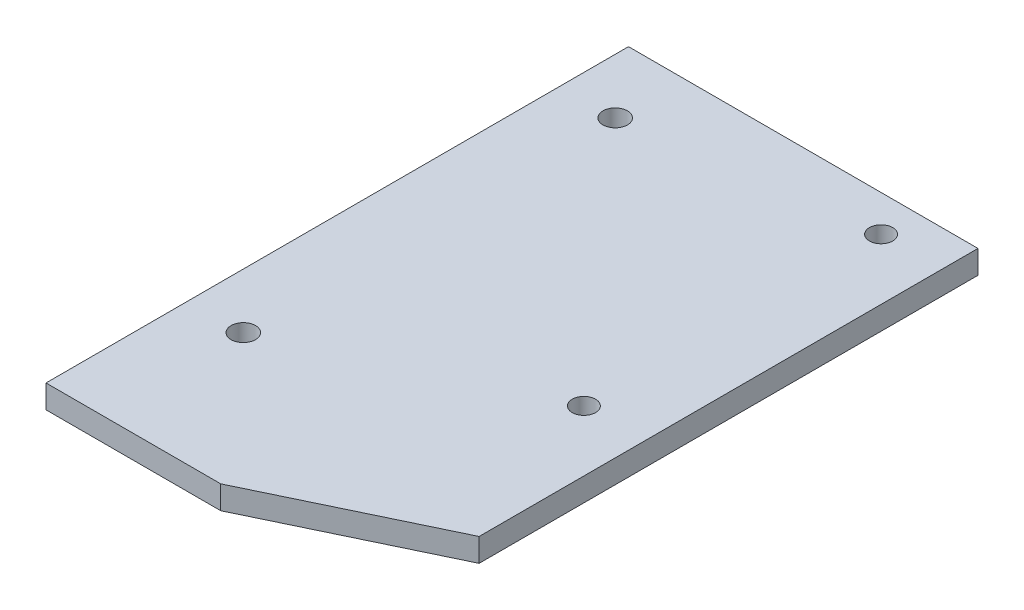
ISO-10303-21;
HEADER;
FILE_DESCRIPTION(('STEP AP214'),'2;1');
FILE_NAME('part.step','',(''),(''),'','','');
FILE_SCHEMA(('AUTOMOTIVE_DESIGN { 1 0 10303 214 1 1 1 1 }'));
ENDSEC;
DATA;
#1=APPLICATION_CONTEXT('core data for automotive mechanical design processes');
#2=APPLICATION_PROTOCOL_DEFINITION('international standard','automotive_design',2000,#1);
#3=PRODUCT_CONTEXT('',#1,'mechanical');
#4=PRODUCT('Part','Part','',(#3));
#5=PRODUCT_RELATED_PRODUCT_CATEGORY('part','',(#4));
#6=PRODUCT_DEFINITION_FORMATION('','',#4);
#7=PRODUCT_DEFINITION_CONTEXT('part definition',#1,'design');
#8=PRODUCT_DEFINITION('design','',#6,#7);
#9=PRODUCT_DEFINITION_SHAPE('','',#8);
#10=(LENGTH_UNIT() NAMED_UNIT(*) SI_UNIT(.MILLI.,.METRE.));
#11=(NAMED_UNIT(*) PLANE_ANGLE_UNIT() SI_UNIT($,.RADIAN.));
#12=(NAMED_UNIT(*) SI_UNIT($,.STERADIAN.) SOLID_ANGLE_UNIT());
#13=UNCERTAINTY_MEASURE_WITH_UNIT(LENGTH_MEASURE(1.E-05),#10,'distance_accuracy_value','');
#14=(GEOMETRIC_REPRESENTATION_CONTEXT(3) GLOBAL_UNCERTAINTY_ASSIGNED_CONTEXT((#13)) GLOBAL_UNIT_ASSIGNED_CONTEXT((#10,
#11,#12)) REPRESENTATION_CONTEXT('',''));
#15=CARTESIAN_POINT('',(0.,0.,0.));
#16=DIRECTION('',(0.,0.,1.));
#17=DIRECTION('',(1.,0.,0.));
#18=AXIS2_PLACEMENT_3D('',#15,#16,#17);
#19=CARTESIAN_POINT('',(0.,2.,0.));
#20=DIRECTION('',(1.,0.,0.));
#21=DIRECTION('',(0.,0.,-1.));
#22=AXIS2_PLACEMENT_3D('',#19,#20,#21);
#23=PLANE('',#22);
#24=DIRECTION('',(0.,0.,1.));
#25=VECTOR('',#24,1.);
#26=CARTESIAN_POINT('',(0.,0.,0.));
#27=LINE('',#26,#25);
#28=CARTESIAN_POINT('',(0.,0.,-50.));
#29=VERTEX_POINT('',#28);
#30=CARTESIAN_POINT('',(0.,0.,0.));
#31=VERTEX_POINT('',#30);
#32=EDGE_CURVE('E124',#29,#31,#27,.T.);
#33=ORIENTED_EDGE('',*,*,#32,.T.);
#34=DIRECTION('',(0.,-1.,0.));
#35=VECTOR('',#34,1.);
#36=CARTESIAN_POINT('',(0.,2.,0.));
#37=LINE('',#36,#35);
#38=CARTESIAN_POINT('',(0.,2.,0.));
#39=VERTEX_POINT('',#38);
#40=EDGE_CURVE('E11',#39,#31,#37,.T.);
#41=ORIENTED_EDGE('',*,*,#40,.F.);
#42=DIRECTION('',(0.,0.,1.));
#43=VECTOR('',#42,1.);
#44=CARTESIAN_POINT('',(0.,2.,0.));
#45=LINE('',#44,#43);
#46=CARTESIAN_POINT('',(0.,2.,-50.));
#47=VERTEX_POINT('',#46);
#48=EDGE_CURVE('E138',#47,#39,#45,.T.);
#49=ORIENTED_EDGE('',*,*,#48,.F.);
#50=DIRECTION('',(0.,-1.,0.));
#51=VECTOR('',#50,1.);
#52=CARTESIAN_POINT('',(0.,2.,-50.));
#53=LINE('',#52,#51);
#54=EDGE_CURVE('E120',#47,#29,#53,.T.);
#55=ORIENTED_EDGE('',*,*,#54,.T.);
#56=EDGE_LOOP('',(#33,#41,#49,#55));
#57=FACE_BOUND('',#56,.T.);
#58=ADVANCED_FACE('F45',(#57),#23,.F.);
#59=CARTESIAN_POINT('',(0.,2.,0.));
#60=DIRECTION('',(0.,0.,-1.));
#61=DIRECTION('',(-1.,0.,0.));
#62=AXIS2_PLACEMENT_3D('',#59,#60,#61);
#63=PLANE('',#62);
#64=DIRECTION('',(1.,0.,0.));
#65=VECTOR('',#64,1.);
#66=CARTESIAN_POINT('',(0.,0.,0.));
#67=LINE('',#66,#65);
#68=CARTESIAN_POINT('',(15.,0.,0.));
#69=VERTEX_POINT('',#68);
#70=EDGE_CURVE('E128',#31,#69,#67,.T.);
#71=ORIENTED_EDGE('',*,*,#70,.T.);
#72=DIRECTION('',(0.,-1.,0.));
#73=VECTOR('',#72,1.);
#74=CARTESIAN_POINT('',(15.,2.,0.));
#75=LINE('',#74,#73);
#76=CARTESIAN_POINT('',(15.,2.,0.));
#77=VERTEX_POINT('',#76);
#78=EDGE_CURVE('E54',#77,#69,#75,.T.);
#79=ORIENTED_EDGE('',*,*,#78,.F.);
#80=DIRECTION('',(1.,0.,0.));
#81=VECTOR('',#80,1.);
#82=CARTESIAN_POINT('',(0.,2.,0.));
#83=LINE('',#82,#81);
#84=EDGE_CURVE('E96',#39,#77,#83,.T.);
#85=ORIENTED_EDGE('',*,*,#84,.F.);
#86=ORIENTED_EDGE('',*,*,#40,.T.);
#87=EDGE_LOOP('',(#71,#79,#85,#86));
#88=FACE_BOUND('',#87,.T.);
#89=ADVANCED_FACE('F161',(#88),#63,.F.);
#90=CARTESIAN_POINT('',(15.,2.,0.));
#91=DIRECTION('',(-0.431592675720647,0.,-0.902068601750606));
#92=DIRECTION('',(-0.902068601750605,0.,0.431592675720647));
#93=AXIS2_PLACEMENT_3D('',#90,#91,#92);
#94=PLANE('',#93);
#95=DIRECTION('',(0.902068601750605,0.,-0.431592675720647));
#96=VECTOR('',#95,1.);
#97=CARTESIAN_POINT('',(15.,0.,0.));
#98=LINE('',#97,#96);
#99=CARTESIAN_POINT('',(30.,0.,-7.17671596511187));
#100=VERTEX_POINT('',#99);
#101=EDGE_CURVE('E112',#69,#100,#98,.T.);
#102=ORIENTED_EDGE('',*,*,#101,.T.);
#103=DIRECTION('',(0.,-1.,0.));
#104=VECTOR('',#103,1.);
#105=CARTESIAN_POINT('',(30.,2.,-7.17671596511187));
#106=LINE('',#105,#104);
#107=CARTESIAN_POINT('',(30.,2.,-7.17671596511187));
#108=VERTEX_POINT('',#107);
#109=EDGE_CURVE('E109',#108,#100,#106,.T.);
#110=ORIENTED_EDGE('',*,*,#109,.F.);
#111=DIRECTION('',(0.902068601750605,0.,-0.431592675720647));
#112=VECTOR('',#111,1.);
#113=CARTESIAN_POINT('',(15.,2.,0.));
#114=LINE('',#113,#112);
#115=EDGE_CURVE('E100',#77,#108,#114,.T.);
#116=ORIENTED_EDGE('',*,*,#115,.F.);
#117=ORIENTED_EDGE('',*,*,#78,.T.);
#118=EDGE_LOOP('',(#102,#110,#116,#117));
#119=FACE_BOUND('',#118,.T.);
#120=ADVANCED_FACE('F110',(#119),#94,.F.);
#121=CARTESIAN_POINT('',(30.,2.,-7.17671596511187));
#122=DIRECTION('',(-1.,0.,0.));
#123=DIRECTION('',(0.,0.,1.));
#124=AXIS2_PLACEMENT_3D('',#121,#122,#123);
#125=PLANE('',#124);
#126=DIRECTION('',(0.,0.,-1.));
#127=VECTOR('',#126,1.);
#128=CARTESIAN_POINT('',(30.,0.,-7.17671596511187));
#129=LINE('',#128,#127);
#130=CARTESIAN_POINT('',(30.,0.,-50.));
#131=VERTEX_POINT('',#130);
#132=EDGE_CURVE('E82',#100,#131,#129,.T.);
#133=ORIENTED_EDGE('',*,*,#132,.T.);
#134=DIRECTION('',(0.,-1.,0.));
#135=VECTOR('',#134,1.);
#136=CARTESIAN_POINT('',(30.,2.,-50.));
#137=LINE('',#136,#135);
#138=CARTESIAN_POINT('',(30.,2.,-50.));
#139=VERTEX_POINT('',#138);
#140=EDGE_CURVE('E114',#139,#131,#137,.T.);
#141=ORIENTED_EDGE('',*,*,#140,.F.);
#142=DIRECTION('',(0.,0.,-1.));
#143=VECTOR('',#142,1.);
#144=CARTESIAN_POINT('',(30.,2.,-7.17671596511187));
#145=LINE('',#144,#143);
#146=EDGE_CURVE('E104',#108,#139,#145,.T.);
#147=ORIENTED_EDGE('',*,*,#146,.F.);
#148=ORIENTED_EDGE('',*,*,#109,.T.);
#149=EDGE_LOOP('',(#133,#141,#147,#148));
#150=FACE_BOUND('',#149,.T.);
#151=ADVANCED_FACE('F116',(#150),#125,.F.);
#152=CARTESIAN_POINT('',(0.,2.,-50.));
#153=DIRECTION('',(0.,0.,1.));
#154=DIRECTION('',(1.,0.,0.));
#155=AXIS2_PLACEMENT_3D('',#152,#153,#154);
#156=PLANE('',#155);
#157=DIRECTION('',(-1.,0.,0.));
#158=VECTOR('',#157,1.);
#159=CARTESIAN_POINT('',(0.,0.,-50.));
#160=LINE('',#159,#158);
#161=EDGE_CURVE('E88',#131,#29,#160,.T.);
#162=ORIENTED_EDGE('',*,*,#161,.T.);
#163=ORIENTED_EDGE('',*,*,#54,.F.);
#164=DIRECTION('',(-1.,0.,0.));
#165=VECTOR('',#164,1.);
#166=CARTESIAN_POINT('',(0.,2.,-50.));
#167=LINE('',#166,#165);
#168=EDGE_CURVE('E62',#139,#47,#167,.T.);
#169=ORIENTED_EDGE('',*,*,#168,.F.);
#170=ORIENTED_EDGE('',*,*,#140,.T.);
#171=EDGE_LOOP('',(#162,#163,#169,#170));
#172=FACE_BOUND('',#171,.T.);
#173=ADVANCED_FACE('F149',(#172),#156,.F.);
#174=CARTESIAN_POINT('',(0.,2.,0.));
#175=DIRECTION('',(0.,-1.,0.));
#176=DIRECTION('',(0.,0.,-1.));
#177=AXIS2_PLACEMENT_3D('',#174,#175,#176);
#178=PLANE('',#177);
#179=CARTESIAN_POINT('',(4.72661771296583,2.,-12.2099837970145));
#180=DIRECTION('',(0.,1.,0.));
#181=DIRECTION('',(0.,0.,1.));
#182=AXIS2_PLACEMENT_3D('',#179,#180,#181);
#183=CIRCLE('',#182,1.05);
#184=CARTESIAN_POINT('',(4.72661771296583,2.,-11.1599837970145));
#185=VERTEX_POINT('',#184);
#186=EDGE_CURVE('E243',#185,#185,#183,.T.);
#187=ORIENTED_EDGE('',*,*,#186,.F.);
#188=EDGE_LOOP('',(#187));
#189=FACE_BOUND('',#188,.T.);
#190=CARTESIAN_POINT('',(4.72661771296583,2.,-44.133312648671));
#191=DIRECTION('',(0.,1.,0.));
#192=DIRECTION('',(0.,0.,1.));
#193=AXIS2_PLACEMENT_3D('',#190,#191,#192);
#194=CIRCLE('',#193,1.05);
#195=CARTESIAN_POINT('',(4.72661771296583,2.,-43.083312648671));
#196=VERTEX_POINT('',#195);
#197=EDGE_CURVE('E245',#196,#196,#194,.T.);
#198=ORIENTED_EDGE('',*,*,#197,.F.);
#199=EDGE_LOOP('',(#198));
#200=FACE_BOUND('',#199,.T.);
#201=CARTESIAN_POINT('',(24.7907401661668,2.,-46.891267625056));
#202=DIRECTION('',(0.,1.,0.));
#203=DIRECTION('',(0.,0.,1.));
#204=AXIS2_PLACEMENT_3D('',#201,#202,#203);
#205=CIRCLE('',#204,1.);
#206=CARTESIAN_POINT('',(24.7907401661668,2.,-45.891267625056));
#207=VERTEX_POINT('',#206);
#208=EDGE_CURVE('E257',#207,#207,#205,.T.);
#209=ORIENTED_EDGE('',*,*,#208,.F.);
#210=EDGE_LOOP('',(#209));
#211=FACE_BOUND('',#210,.T.);
#212=CARTESIAN_POINT('',(24.7907401661668,2.,-21.3801840934947));
#213=DIRECTION('',(0.,1.,0.));
#214=DIRECTION('',(0.,0.,1.));
#215=AXIS2_PLACEMENT_3D('',#212,#213,#214);
#216=CIRCLE('',#215,1.);
#217=CARTESIAN_POINT('',(24.7907401661668,2.,-20.3801840934947));
#218=VERTEX_POINT('',#217);
#219=EDGE_CURVE('E265',#218,#218,#216,.T.);
#220=ORIENTED_EDGE('',*,*,#219,.F.);
#221=EDGE_LOOP('',(#220));
#222=FACE_BOUND('',#221,.T.);
#223=ORIENTED_EDGE('',*,*,#48,.T.);
#224=ORIENTED_EDGE('',*,*,#84,.T.);
#225=ORIENTED_EDGE('',*,*,#115,.T.);
#226=ORIENTED_EDGE('',*,*,#146,.T.);
#227=ORIENTED_EDGE('',*,*,#168,.T.);
#228=EDGE_LOOP('',(#223,#224,#225,#226,#227));
#229=FACE_BOUND('',#228,.T.);
#230=ADVANCED_FACE('F102',(#189,#200,#211,#222,#229),#178,.F.);
#231=CARTESIAN_POINT('',(0.,0.,0.));
#232=DIRECTION('',(0.,-1.,0.));
#233=DIRECTION('',(0.,0.,-1.));
#234=AXIS2_PLACEMENT_3D('',#231,#232,#233);
#235=PLANE('',#234);
#236=CARTESIAN_POINT('',(4.72661771296583,0.,-12.2099837970145));
#237=DIRECTION('',(0.,1.,0.));
#238=DIRECTION('',(0.,0.,1.));
#239=AXIS2_PLACEMENT_3D('',#236,#237,#238);
#240=CIRCLE('',#239,1.05);
#241=CARTESIAN_POINT('',(4.72661771296583,0.,-11.1599837970145));
#242=VERTEX_POINT('',#241);
#243=EDGE_CURVE('E129',#242,#242,#240,.T.);
#244=ORIENTED_EDGE('',*,*,#243,.T.);
#245=EDGE_LOOP('',(#244));
#246=FACE_BOUND('',#245,.T.);
#247=CARTESIAN_POINT('',(4.72661771296583,0.,-44.133312648671));
#248=DIRECTION('',(0.,1.,0.));
#249=DIRECTION('',(0.,0.,1.));
#250=AXIS2_PLACEMENT_3D('',#247,#248,#249);
#251=CIRCLE('',#250,1.05);
#252=CARTESIAN_POINT('',(4.72661771296583,0.,-43.083312648671));
#253=VERTEX_POINT('',#252);
#254=EDGE_CURVE('E251',#253,#253,#251,.T.);
#255=ORIENTED_EDGE('',*,*,#254,.T.);
#256=EDGE_LOOP('',(#255));
#257=FACE_BOUND('',#256,.T.);
#258=CARTESIAN_POINT('',(24.7907401661668,0.,-46.891267625056));
#259=DIRECTION('',(0.,1.,0.));
#260=DIRECTION('',(0.,0.,1.));
#261=AXIS2_PLACEMENT_3D('',#258,#259,#260);
#262=CIRCLE('',#261,1.);
#263=CARTESIAN_POINT('',(24.7907401661668,0.,-45.891267625056));
#264=VERTEX_POINT('',#263);
#265=EDGE_CURVE('E261',#264,#264,#262,.T.);
#266=ORIENTED_EDGE('',*,*,#265,.T.);
#267=EDGE_LOOP('',(#266));
#268=FACE_BOUND('',#267,.T.);
#269=CARTESIAN_POINT('',(24.7907401661668,0.,-21.3801840934947));
#270=DIRECTION('',(0.,1.,0.));
#271=DIRECTION('',(0.,0.,1.));
#272=AXIS2_PLACEMENT_3D('',#269,#270,#271);
#273=CIRCLE('',#272,1.);
#274=CARTESIAN_POINT('',(24.7907401661668,0.,-20.3801840934947));
#275=VERTEX_POINT('',#274);
#276=EDGE_CURVE('E269',#275,#275,#273,.T.);
#277=ORIENTED_EDGE('',*,*,#276,.T.);
#278=EDGE_LOOP('',(#277));
#279=FACE_BOUND('',#278,.T.);
#280=ORIENTED_EDGE('',*,*,#32,.F.);
#281=ORIENTED_EDGE('',*,*,#161,.F.);
#282=ORIENTED_EDGE('',*,*,#132,.F.);
#283=ORIENTED_EDGE('',*,*,#101,.F.);
#284=ORIENTED_EDGE('',*,*,#70,.F.);
#285=EDGE_LOOP('',(#280,#281,#282,#283,#284));
#286=FACE_BOUND('',#285,.T.);
#287=ADVANCED_FACE('F145',(#246,#257,#268,#279,#286),#235,.T.);
#288=CARTESIAN_POINT('',(24.7907401661668,0.,-21.3801840934947));
#289=DIRECTION('',(0.,1.,0.));
#290=DIRECTION('',(0.,0.,1.));
#291=AXIS2_PLACEMENT_3D('',#288,#289,#290);
#292=CYLINDRICAL_SURFACE('',#291,1.);
#293=ORIENTED_EDGE('',*,*,#276,.F.);
#294=EDGE_LOOP('',(#293));
#295=FACE_BOUND('',#294,.T.);
#296=ORIENTED_EDGE('',*,*,#219,.T.);
#297=EDGE_LOOP('',(#296));
#298=FACE_BOUND('',#297,.T.);
#299=ADVANCED_FACE('F196',(#295,#298),#292,.F.);
#300=CARTESIAN_POINT('',(24.7907401661668,0.,-46.891267625056));
#301=DIRECTION('',(0.,1.,0.));
#302=DIRECTION('',(0.,0.,1.));
#303=AXIS2_PLACEMENT_3D('',#300,#301,#302);
#304=CYLINDRICAL_SURFACE('',#303,1.);
#305=ORIENTED_EDGE('',*,*,#265,.F.);
#306=EDGE_LOOP('',(#305));
#307=FACE_BOUND('',#306,.T.);
#308=ORIENTED_EDGE('',*,*,#208,.T.);
#309=EDGE_LOOP('',(#308));
#310=FACE_BOUND('',#309,.T.);
#311=ADVANCED_FACE('F205',(#307,#310),#304,.F.);
#312=CARTESIAN_POINT('',(4.72661771296583,0.,-44.133312648671));
#313=DIRECTION('',(0.,1.,0.));
#314=DIRECTION('',(0.,0.,1.));
#315=AXIS2_PLACEMENT_3D('',#312,#313,#314);
#316=CYLINDRICAL_SURFACE('',#315,1.05);
#317=ORIENTED_EDGE('',*,*,#254,.F.);
#318=EDGE_LOOP('',(#317));
#319=FACE_BOUND('',#318,.T.);
#320=ORIENTED_EDGE('',*,*,#197,.T.);
#321=EDGE_LOOP('',(#320));
#322=FACE_BOUND('',#321,.T.);
#323=ADVANCED_FACE('F215',(#319,#322),#316,.F.);
#324=CARTESIAN_POINT('',(4.72661771296583,0.,-12.2099837970145));
#325=DIRECTION('',(0.,1.,0.));
#326=DIRECTION('',(0.,0.,1.));
#327=AXIS2_PLACEMENT_3D('',#324,#325,#326);
#328=CYLINDRICAL_SURFACE('',#327,1.05);
#329=ORIENTED_EDGE('',*,*,#243,.F.);
#330=EDGE_LOOP('',(#329));
#331=FACE_BOUND('',#330,.T.);
#332=ORIENTED_EDGE('',*,*,#186,.T.);
#333=EDGE_LOOP('',(#332));
#334=FACE_BOUND('',#333,.T.);
#335=ADVANCED_FACE('F225',(#331,#334),#328,.F.);
#336=CLOSED_SHELL('',(#58,#89,#120,#151,#173,#230,#287,#299,#311,#323,#335));
#337=MANIFOLD_SOLID_BREP('B2',#336);
#338=ADVANCED_BREP_SHAPE_REPRESENTATION('',(#18,#337),#14);
#339=SHAPE_DEFINITION_REPRESENTATION(#9,#338);
ENDSEC;
END-ISO-10303-21;
